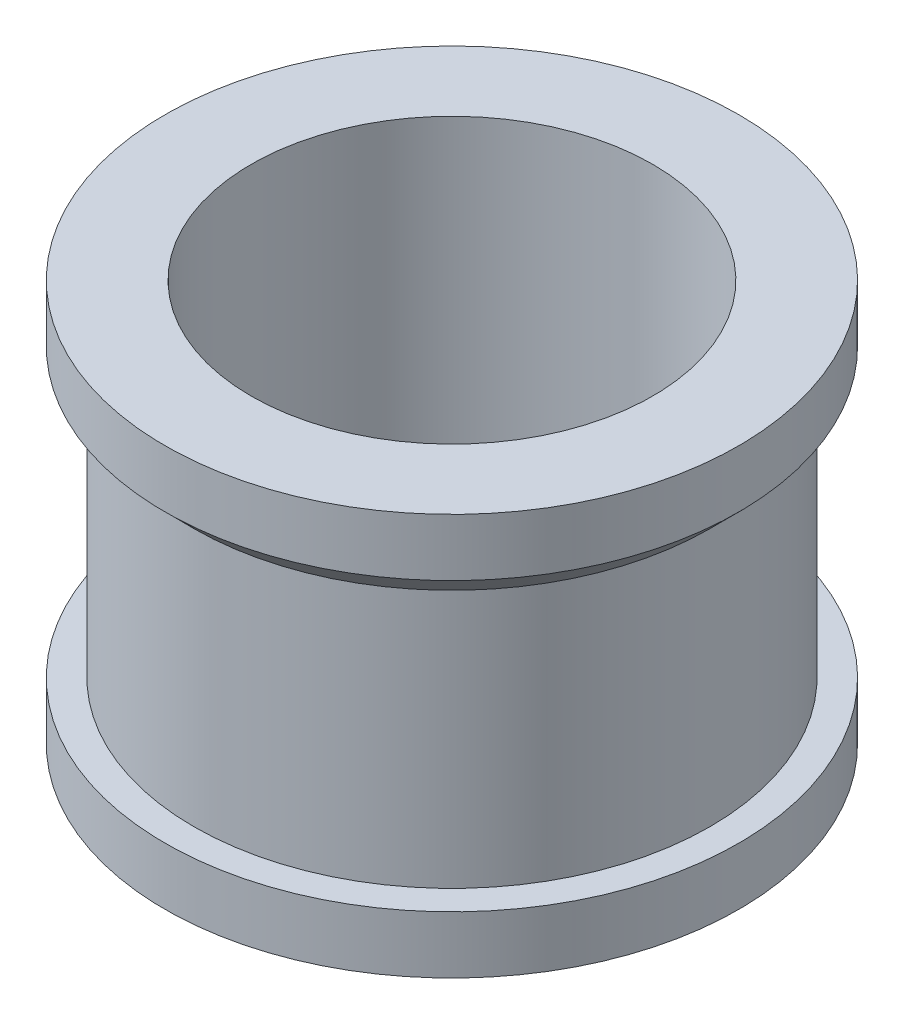
ISO-10303-21;
HEADER;
FILE_DESCRIPTION(('STEP AP214'),'2;1');
FILE_NAME('part.step','',(''),(''),'','','');
FILE_SCHEMA(('AUTOMOTIVE_DESIGN { 1 0 10303 214 1 1 1 1 }'));
ENDSEC;
DATA;
#1=APPLICATION_CONTEXT('core data for automotive mechanical design processes');
#2=APPLICATION_PROTOCOL_DEFINITION('international standard','automotive_design',2000,#1);
#3=PRODUCT_CONTEXT('',#1,'mechanical');
#4=PRODUCT('Part','Part','',(#3));
#5=PRODUCT_RELATED_PRODUCT_CATEGORY('part','',(#4));
#6=PRODUCT_DEFINITION_FORMATION('','',#4);
#7=PRODUCT_DEFINITION_CONTEXT('part definition',#1,'design');
#8=PRODUCT_DEFINITION('design','',#6,#7);
#9=PRODUCT_DEFINITION_SHAPE('','',#8);
#10=(LENGTH_UNIT() NAMED_UNIT(*) SI_UNIT(.MILLI.,.METRE.));
#11=(NAMED_UNIT(*) PLANE_ANGLE_UNIT() SI_UNIT($,.RADIAN.));
#12=(NAMED_UNIT(*) SI_UNIT($,.STERADIAN.) SOLID_ANGLE_UNIT());
#13=UNCERTAINTY_MEASURE_WITH_UNIT(LENGTH_MEASURE(1.E-05),#10,'distance_accuracy_value','');
#14=(GEOMETRIC_REPRESENTATION_CONTEXT(3) GLOBAL_UNCERTAINTY_ASSIGNED_CONTEXT((#13)) GLOBAL_UNIT_ASSIGNED_CONTEXT((#10,
#11,#12)) REPRESENTATION_CONTEXT('',''));
#15=CARTESIAN_POINT('',(0.,0.,0.));
#16=DIRECTION('',(0.,0.,1.));
#17=DIRECTION('',(1.,0.,0.));
#18=AXIS2_PLACEMENT_3D('',#15,#16,#17);
#19=CARTESIAN_POINT('',(10.,0.,0.));
#20=DIRECTION('',(0.,-1.,0.));
#21=DIRECTION('',(0.,0.,-1.));
#22=AXIS2_PLACEMENT_3D('',#19,#20,#21);
#23=PLANE('',#22);
#24=CARTESIAN_POINT('',(0.,0.,0.));
#25=DIRECTION('',(0.,-1.,0.));
#26=DIRECTION('',(0.,0.,-1.));
#27=AXIS2_PLACEMENT_3D('',#24,#25,#26);
#28=CIRCLE('',#27,10.);
#29=CARTESIAN_POINT('',(0.,0.,-10.));
#30=VERTEX_POINT('',#29);
#31=EDGE_CURVE('E60',#30,#30,#28,.T.);
#32=ORIENTED_EDGE('',*,*,#31,.T.);
#33=EDGE_LOOP('',(#32));
#34=FACE_BOUND('',#33,.T.);
#35=CARTESIAN_POINT('',(0.,0.,0.));
#36=DIRECTION('',(0.,-1.,0.));
#37=DIRECTION('',(0.,0.,-1.));
#38=AXIS2_PLACEMENT_3D('',#35,#36,#37);
#39=CIRCLE('',#38,7.);
#40=CARTESIAN_POINT('',(0.,0.,-7.));
#41=VERTEX_POINT('',#40);
#42=EDGE_CURVE('E38',#41,#41,#39,.T.);
#43=ORIENTED_EDGE('',*,*,#42,.F.);
#44=EDGE_LOOP('',(#43));
#45=FACE_BOUND('',#44,.T.);
#46=ADVANCED_FACE('F31',(#34,#45),#23,.T.);
#47=CARTESIAN_POINT('',(0.,0.0999999999999973,0.));
#48=DIRECTION('',(0.,-1.,0.));
#49=DIRECTION('',(0.,0.,-1.));
#50=AXIS2_PLACEMENT_3D('',#47,#48,#49);
#51=CYLINDRICAL_SURFACE('',#50,6.99999999999999);
#52=ORIENTED_EDGE('',*,*,#42,.T.);
#53=EDGE_LOOP('',(#52));
#54=FACE_BOUND('',#53,.T.);
#55=CARTESIAN_POINT('',(0.,14.,0.));
#56=DIRECTION('',(0.,-1.,0.));
#57=DIRECTION('',(0.,0.,-1.));
#58=AXIS2_PLACEMENT_3D('',#55,#56,#57);
#59=CIRCLE('',#58,6.99999999999999);
#60=CARTESIAN_POINT('',(0.,14.,-6.99999999999999));
#61=VERTEX_POINT('',#60);
#62=EDGE_CURVE('E42',#61,#61,#59,.T.);
#63=ORIENTED_EDGE('',*,*,#62,.F.);
#64=EDGE_LOOP('',(#63));
#65=FACE_BOUND('',#64,.T.);
#66=ADVANCED_FACE('F80',(#54,#65),#51,.F.);
#67=CARTESIAN_POINT('',(6.99999999999999,14.,0.));
#68=DIRECTION('',(0.,1.,0.));
#69=DIRECTION('',(0.,0.,1.));
#70=AXIS2_PLACEMENT_3D('',#67,#68,#69);
#71=PLANE('',#70);
#72=ORIENTED_EDGE('',*,*,#62,.T.);
#73=EDGE_LOOP('',(#72));
#74=FACE_BOUND('',#73,.T.);
#75=CARTESIAN_POINT('',(0.,14.,0.));
#76=DIRECTION('',(0.,-1.,0.));
#77=DIRECTION('',(0.,0.,-1.));
#78=AXIS2_PLACEMENT_3D('',#75,#76,#77);
#79=CIRCLE('',#78,9.99999999999999);
#80=CARTESIAN_POINT('',(0.,14.,-9.99999999999999));
#81=VERTEX_POINT('',#80);
#82=EDGE_CURVE('E46',#81,#81,#79,.T.);
#83=ORIENTED_EDGE('',*,*,#82,.F.);
#84=EDGE_LOOP('',(#83));
#85=FACE_BOUND('',#84,.T.);
#86=ADVANCED_FACE('F84',(#74,#85),#71,.T.);
#87=CARTESIAN_POINT('',(0.,0.0999999999999973,0.));
#88=DIRECTION('',(0.,-1.,0.));
#89=DIRECTION('',(0.,0.,-1.));
#90=AXIS2_PLACEMENT_3D('',#87,#88,#89);
#91=CYLINDRICAL_SURFACE('',#90,9.99999999999999);
#92=ORIENTED_EDGE('',*,*,#82,.T.);
#93=EDGE_LOOP('',(#92));
#94=FACE_BOUND('',#93,.T.);
#95=CARTESIAN_POINT('',(0.,12.,0.));
#96=DIRECTION('',(0.,-1.,0.));
#97=DIRECTION('',(0.,0.,-1.));
#98=AXIS2_PLACEMENT_3D('',#95,#96,#97);
#99=CIRCLE('',#98,9.99999999999999);
#100=CARTESIAN_POINT('',(0.,12.,-9.99999999999999));
#101=VERTEX_POINT('',#100);
#102=EDGE_CURVE('E51',#101,#101,#99,.T.);
#103=ORIENTED_EDGE('',*,*,#102,.F.);
#104=EDGE_LOOP('',(#103));
#105=FACE_BOUND('',#104,.T.);
#106=ADVANCED_FACE('F89',(#94,#105),#91,.T.);
#107=CARTESIAN_POINT('',(0.,0.0999999999999973,0.));
#108=DIRECTION('',(0.,-1.,0.));
#109=DIRECTION('',(0.,0.,-1.));
#110=AXIS2_PLACEMENT_3D('',#107,#108,#109);
#111=CYLINDRICAL_SURFACE('',#110,9.);
#112=CARTESIAN_POINT('',(0.,11.,0.));
#113=DIRECTION('',(0.,-1.,0.));
#114=DIRECTION('',(0.,0.,-1.));
#115=AXIS2_PLACEMENT_3D('',#112,#113,#114);
#116=CIRCLE('',#115,9.);
#117=CARTESIAN_POINT('',(0.,11.,-9.));
#118=VERTEX_POINT('',#117);
#119=EDGE_CURVE('E10',#118,#118,#116,.T.);
#120=ORIENTED_EDGE('',*,*,#119,.T.);
#121=EDGE_LOOP('',(#120));
#122=FACE_BOUND('',#121,.T.);
#123=CARTESIAN_POINT('',(0.,2.,0.));
#124=DIRECTION('',(0.,-1.,0.));
#125=DIRECTION('',(0.,0.,-1.));
#126=AXIS2_PLACEMENT_3D('',#123,#124,#125);
#127=CIRCLE('',#126,9.);
#128=CARTESIAN_POINT('',(0.,2.,-9.));
#129=VERTEX_POINT('',#128);
#130=EDGE_CURVE('E54',#129,#129,#127,.T.);
#131=ORIENTED_EDGE('',*,*,#130,.F.);
#132=EDGE_LOOP('',(#131));
#133=FACE_BOUND('',#132,.T.);
#134=ADVANCED_FACE('F76',(#122,#133),#111,.T.);
#135=CARTESIAN_POINT('',(9.,2.,0.));
#136=DIRECTION('',(0.,1.,0.));
#137=DIRECTION('',(0.,0.,1.));
#138=AXIS2_PLACEMENT_3D('',#135,#136,#137);
#139=PLANE('',#138);
#140=ORIENTED_EDGE('',*,*,#130,.T.);
#141=EDGE_LOOP('',(#140));
#142=FACE_BOUND('',#141,.T.);
#143=CARTESIAN_POINT('',(0.,2.,0.));
#144=DIRECTION('',(0.,-1.,0.));
#145=DIRECTION('',(0.,0.,-1.));
#146=AXIS2_PLACEMENT_3D('',#143,#144,#145);
#147=CIRCLE('',#146,10.);
#148=CARTESIAN_POINT('',(0.,2.,-10.));
#149=VERTEX_POINT('',#148);
#150=EDGE_CURVE('E57',#149,#149,#147,.T.);
#151=ORIENTED_EDGE('',*,*,#150,.F.);
#152=EDGE_LOOP('',(#151));
#153=FACE_BOUND('',#152,.T.);
#154=ADVANCED_FACE('F68',(#142,#153),#139,.T.);
#155=CARTESIAN_POINT('',(0.,0.0999999999999973,0.));
#156=DIRECTION('',(0.,-1.,0.));
#157=DIRECTION('',(0.,0.,-1.));
#158=AXIS2_PLACEMENT_3D('',#155,#156,#157);
#159=CYLINDRICAL_SURFACE('',#158,10.);
#160=ORIENTED_EDGE('',*,*,#150,.T.);
#161=EDGE_LOOP('',(#160));
#162=FACE_BOUND('',#161,.T.);
#163=ORIENTED_EDGE('',*,*,#31,.F.);
#164=EDGE_LOOP('',(#163));
#165=FACE_BOUND('',#164,.T.);
#166=ADVANCED_FACE('F66',(#162,#165),#159,.T.);
#167=CARTESIAN_POINT('',(0.,11.,0.));
#168=DIRECTION('',(0.,1.,0.));
#169=DIRECTION('',(0.,0.,1.));
#170=AXIS2_PLACEMENT_3D('',#167,#168,#169);
#171=CONICAL_SURFACE('',#170,9.,0.785398163397443);
#172=ORIENTED_EDGE('',*,*,#102,.T.);
#173=EDGE_LOOP('',(#172));
#174=FACE_BOUND('',#173,.T.);
#175=ORIENTED_EDGE('',*,*,#119,.F.);
#176=EDGE_LOOP('',(#175));
#177=FACE_BOUND('',#176,.T.);
#178=ADVANCED_FACE('F33',(#174,#177),#171,.T.);
#179=CLOSED_SHELL('',(#46,#66,#86,#106,#134,#154,#166,#178));
#180=MANIFOLD_SOLID_BREP('B2',#179);
#181=ADVANCED_BREP_SHAPE_REPRESENTATION('',(#18,#180),#14);
#182=SHAPE_DEFINITION_REPRESENTATION(#9,#181);
ENDSEC;
END-ISO-10303-21;
